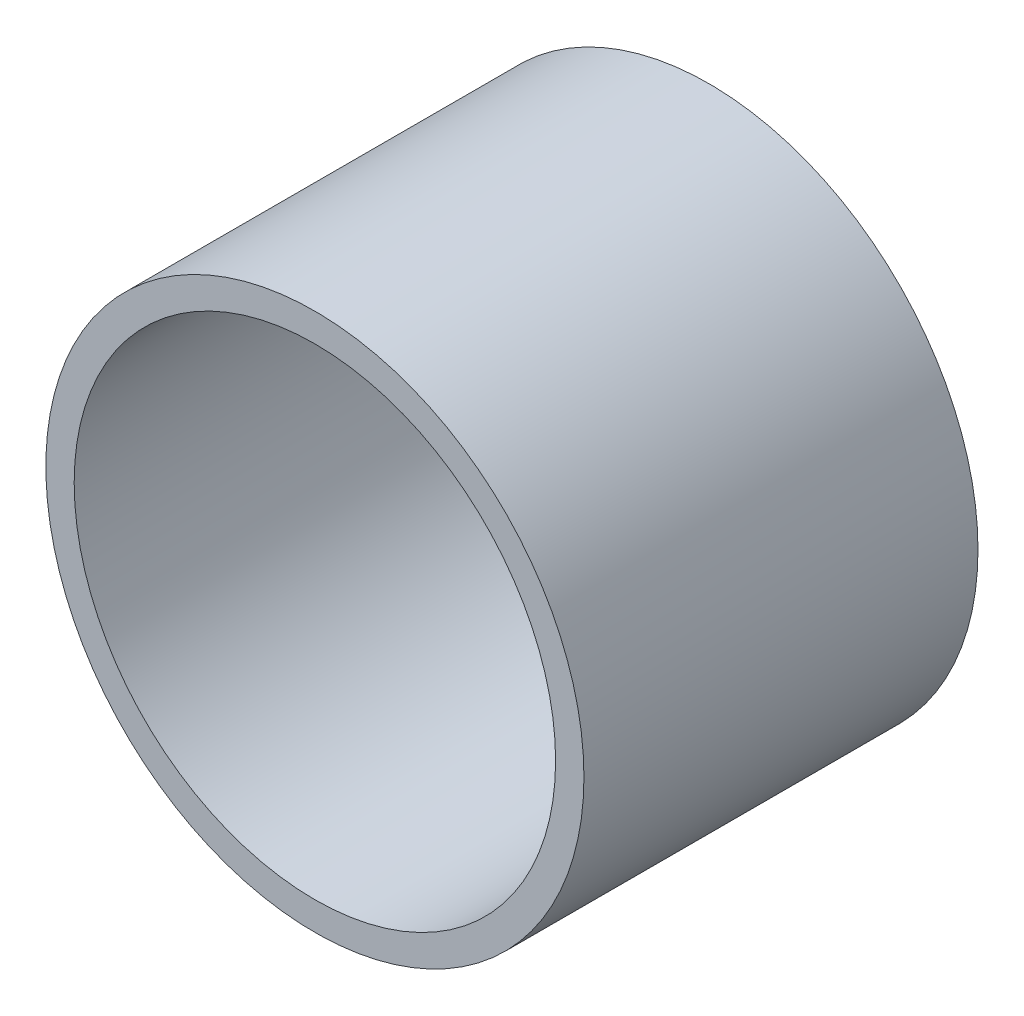
ISO-10303-21;
HEADER;
FILE_DESCRIPTION(('STEP AP214'),'2;1');
FILE_NAME('part.step','',(''),(''),'','','');
FILE_SCHEMA(('AUTOMOTIVE_DESIGN { 1 0 10303 214 1 1 1 1 }'));
ENDSEC;
DATA;
#1=APPLICATION_CONTEXT('core data for automotive mechanical design processes');
#2=APPLICATION_PROTOCOL_DEFINITION('international standard','automotive_design',2000,#1);
#3=PRODUCT_CONTEXT('',#1,'mechanical');
#4=PRODUCT('Part','Part','',(#3));
#5=PRODUCT_RELATED_PRODUCT_CATEGORY('part','',(#4));
#6=PRODUCT_DEFINITION_FORMATION('','',#4);
#7=PRODUCT_DEFINITION_CONTEXT('part definition',#1,'design');
#8=PRODUCT_DEFINITION('design','',#6,#7);
#9=PRODUCT_DEFINITION_SHAPE('','',#8);
#10=(LENGTH_UNIT() NAMED_UNIT(*) SI_UNIT(.MILLI.,.METRE.));
#11=(NAMED_UNIT(*) PLANE_ANGLE_UNIT() SI_UNIT($,.RADIAN.));
#12=(NAMED_UNIT(*) SI_UNIT($,.STERADIAN.) SOLID_ANGLE_UNIT());
#13=UNCERTAINTY_MEASURE_WITH_UNIT(LENGTH_MEASURE(1.E-05),#10,'distance_accuracy_value','');
#14=(GEOMETRIC_REPRESENTATION_CONTEXT(3) GLOBAL_UNCERTAINTY_ASSIGNED_CONTEXT((#13)) GLOBAL_UNIT_ASSIGNED_CONTEXT((#10,
#11,#12)) REPRESENTATION_CONTEXT('',''));
#15=CARTESIAN_POINT('',(0.,0.,0.));
#16=DIRECTION('',(0.,0.,1.));
#17=DIRECTION('',(1.,0.,0.));
#18=AXIS2_PLACEMENT_3D('',#15,#16,#17);
#19=CARTESIAN_POINT('',(0.,0.,41.85));
#20=DIRECTION('',(0.,0.,1.));
#21=DIRECTION('',(1.,0.,0.));
#22=AXIS2_PLACEMENT_3D('',#19,#20,#21);
#23=PLANE('',#22);
#24=CARTESIAN_POINT('',(0.,0.,41.85));
#25=DIRECTION('',(0.,0.,1.));
#26=DIRECTION('',(1.,0.,0.));
#27=AXIS2_PLACEMENT_3D('',#24,#25,#26);
#28=CIRCLE('',#27,57.15);
#29=CARTESIAN_POINT('',(57.15,0.,41.85));
#30=VERTEX_POINT('',#29);
#31=EDGE_CURVE('E11',#30,#30,#28,.T.);
#32=ORIENTED_EDGE('',*,*,#31,.T.);
#33=EDGE_LOOP('',(#32));
#34=FACE_BOUND('',#33,.T.);
#35=CARTESIAN_POINT('',(0.,0.,41.85));
#36=DIRECTION('',(0.,0.,1.));
#37=DIRECTION('',(1.,0.,0.));
#38=AXIS2_PLACEMENT_3D('',#35,#36,#37);
#39=CIRCLE('',#38,51.1302);
#40=CARTESIAN_POINT('',(51.1302,0.,41.85));
#41=VERTEX_POINT('',#40);
#42=EDGE_CURVE('E48',#41,#41,#39,.T.);
#43=ORIENTED_EDGE('',*,*,#42,.F.);
#44=EDGE_LOOP('',(#43));
#45=FACE_BOUND('',#44,.T.);
#46=ADVANCED_FACE('F37',(#34,#45),#23,.T.);
#47=CARTESIAN_POINT('',(0.,0.,-41.85));
#48=DIRECTION('',(0.,0.,1.));
#49=DIRECTION('',(1.,0.,0.));
#50=AXIS2_PLACEMENT_3D('',#47,#48,#49);
#51=PLANE('',#50);
#52=CARTESIAN_POINT('',(0.,0.,-41.85));
#53=DIRECTION('',(0.,0.,1.));
#54=DIRECTION('',(1.,0.,0.));
#55=AXIS2_PLACEMENT_3D('',#52,#53,#54);
#56=CIRCLE('',#55,57.15);
#57=CARTESIAN_POINT('',(57.15,0.,-41.85));
#58=VERTEX_POINT('',#57);
#59=EDGE_CURVE('E41',#58,#58,#56,.T.);
#60=ORIENTED_EDGE('',*,*,#59,.F.);
#61=EDGE_LOOP('',(#60));
#62=FACE_BOUND('',#61,.T.);
#63=CARTESIAN_POINT('',(0.,0.,-41.85));
#64=DIRECTION('',(0.,0.,1.));
#65=DIRECTION('',(1.,0.,0.));
#66=AXIS2_PLACEMENT_3D('',#63,#64,#65);
#67=CIRCLE('',#66,51.1302);
#68=CARTESIAN_POINT('',(51.1302,0.,-41.85));
#69=VERTEX_POINT('',#68);
#70=EDGE_CURVE('E50',#69,#69,#67,.T.);
#71=ORIENTED_EDGE('',*,*,#70,.T.);
#72=EDGE_LOOP('',(#71));
#73=FACE_BOUND('',#72,.T.);
#74=ADVANCED_FACE('F60',(#62,#73),#51,.F.);
#75=CARTESIAN_POINT('',(0.,0.,41.85));
#76=DIRECTION('',(0.,0.,-1.));
#77=DIRECTION('',(-1.,0.,0.));
#78=AXIS2_PLACEMENT_3D('',#75,#76,#77);
#79=CYLINDRICAL_SURFACE('',#78,57.15);
#80=ORIENTED_EDGE('',*,*,#31,.F.);
#81=EDGE_LOOP('',(#80));
#82=FACE_BOUND('',#81,.T.);
#83=ORIENTED_EDGE('',*,*,#59,.T.);
#84=EDGE_LOOP('',(#83));
#85=FACE_BOUND('',#84,.T.);
#86=ADVANCED_FACE('F39',(#82,#85),#79,.T.);
#87=CARTESIAN_POINT('',(0.,0.,41.85));
#88=DIRECTION('',(0.,0.,-1.));
#89=DIRECTION('',(-1.,0.,0.));
#90=AXIS2_PLACEMENT_3D('',#87,#88,#89);
#91=CYLINDRICAL_SURFACE('',#90,51.1302);
#92=ORIENTED_EDGE('',*,*,#42,.T.);
#93=EDGE_LOOP('',(#92));
#94=FACE_BOUND('',#93,.T.);
#95=ORIENTED_EDGE('',*,*,#70,.F.);
#96=EDGE_LOOP('',(#95));
#97=FACE_BOUND('',#96,.T.);
#98=ADVANCED_FACE('F56',(#94,#97),#91,.F.);
#99=CLOSED_SHELL('',(#46,#74,#86,#98));
#100=MANIFOLD_SOLID_BREP('B2',#99);
#101=ADVANCED_BREP_SHAPE_REPRESENTATION('',(#18,#100),#14);
#102=SHAPE_DEFINITION_REPRESENTATION(#9,#101);
ENDSEC;
END-ISO-10303-21;
